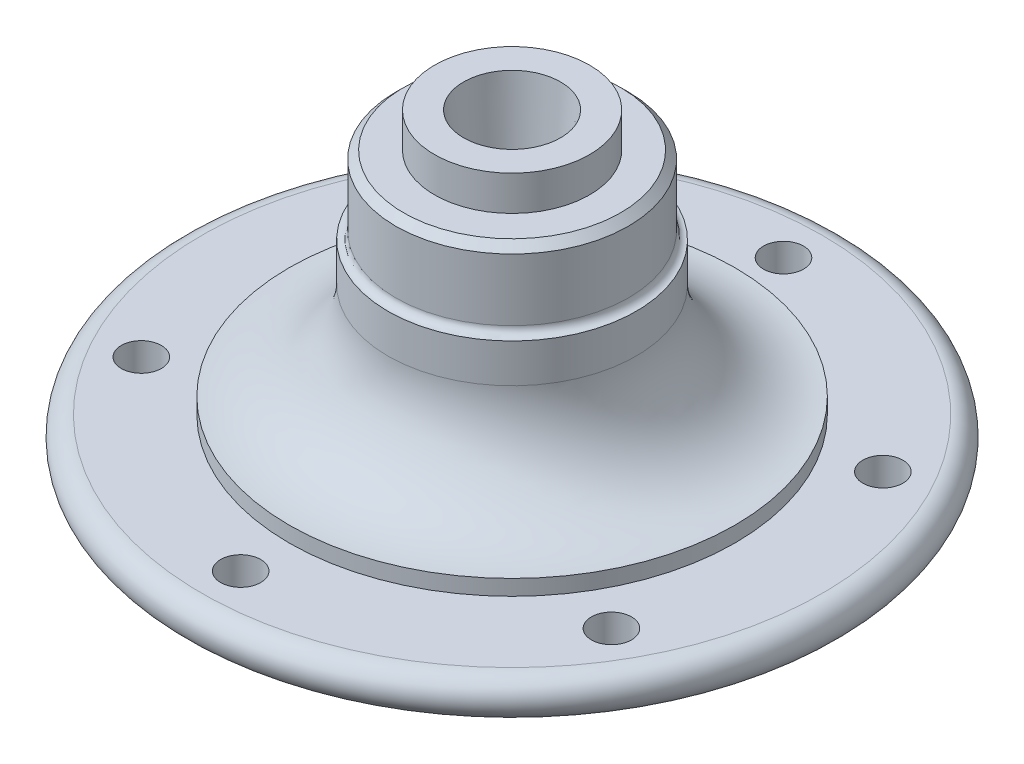
ISO-10303-21;
HEADER;
FILE_DESCRIPTION(('STEP AP214'),'2;1');
FILE_NAME('part.step','',(''),(''),'','','');
FILE_SCHEMA(('AUTOMOTIVE_DESIGN { 1 0 10303 214 1 1 1 1 }'));
ENDSEC;
DATA;
#1=APPLICATION_CONTEXT('core data for automotive mechanical design processes');
#2=APPLICATION_PROTOCOL_DEFINITION('international standard','automotive_design',2000,#1);
#3=PRODUCT_CONTEXT('',#1,'mechanical');
#4=PRODUCT('Part','Part','',(#3));
#5=PRODUCT_RELATED_PRODUCT_CATEGORY('part','',(#4));
#6=PRODUCT_DEFINITION_FORMATION('','',#4);
#7=PRODUCT_DEFINITION_CONTEXT('part definition',#1,'design');
#8=PRODUCT_DEFINITION('design','',#6,#7);
#9=PRODUCT_DEFINITION_SHAPE('','',#8);
#10=(LENGTH_UNIT() NAMED_UNIT(*) SI_UNIT(.MILLI.,.METRE.));
#11=(NAMED_UNIT(*) PLANE_ANGLE_UNIT() SI_UNIT($,.RADIAN.));
#12=(NAMED_UNIT(*) SI_UNIT($,.STERADIAN.) SOLID_ANGLE_UNIT());
#13=UNCERTAINTY_MEASURE_WITH_UNIT(LENGTH_MEASURE(1.E-05),#10,'distance_accuracy_value','');
#14=(GEOMETRIC_REPRESENTATION_CONTEXT(3) GLOBAL_UNCERTAINTY_ASSIGNED_CONTEXT((#13)) GLOBAL_UNIT_ASSIGNED_CONTEXT((#10,
#11,#12)) REPRESENTATION_CONTEXT('',''));
#15=CARTESIAN_POINT('',(0.,0.,0.));
#16=DIRECTION('',(0.,0.,1.));
#17=DIRECTION('',(1.,0.,0.));
#18=AXIS2_PLACEMENT_3D('',#15,#16,#17);
#19=CARTESIAN_POINT('',(0.,0.,0.));
#20=DIRECTION('',(0.,-1.,0.));
#21=DIRECTION('',(0.,0.,-1.));
#22=AXIS2_PLACEMENT_3D('',#19,#20,#21);
#23=PLANE('',#22);
#24=CARTESIAN_POINT('',(0.,0.,0.));
#25=DIRECTION('',(0.,-1.,0.));
#26=DIRECTION('',(0.,0.,-1.));
#27=AXIS2_PLACEMENT_3D('',#24,#25,#26);
#28=CIRCLE('',#27,40.);
#29=CARTESIAN_POINT('',(0.,0.,-40.));
#30=VERTEX_POINT('',#29);
#31=EDGE_CURVE('E12',#30,#30,#28,.T.);
#32=ORIENTED_EDGE('',*,*,#31,.T.);
#33=EDGE_LOOP('',(#32));
#34=FACE_BOUND('',#33,.T.);
#35=ADVANCED_FACE('F45',(#34),#23,.T.);
#36=CARTESIAN_POINT('',(0.,0.,0.));
#37=DIRECTION('',(0.,-1.,0.));
#38=DIRECTION('',(0.,0.,-1.));
#39=AXIS2_PLACEMENT_3D('',#36,#37,#38);
#40=CYLINDRICAL_SURFACE('',#39,40.);
#41=CARTESIAN_POINT('',(0.,12.,0.));
#42=DIRECTION('',(0.,-1.,0.));
#43=DIRECTION('',(0.,0.,-1.));
#44=AXIS2_PLACEMENT_3D('',#41,#42,#43);
#45=CIRCLE('',#44,40.);
#46=CARTESIAN_POINT('',(0.,12.,-40.));
#47=VERTEX_POINT('',#46);
#48=EDGE_CURVE('E52',#47,#47,#45,.T.);
#49=ORIENTED_EDGE('',*,*,#48,.T.);
#50=EDGE_LOOP('',(#49));
#51=FACE_BOUND('',#50,.T.);
#52=ORIENTED_EDGE('',*,*,#31,.F.);
#53=EDGE_LOOP('',(#52));
#54=FACE_BOUND('',#53,.T.);
#55=ADVANCED_FACE('F150',(#51,#54),#40,.T.);
#56=CARTESIAN_POINT('',(40.,12.,0.));
#57=DIRECTION('',(0.,-1.,0.));
#58=DIRECTION('',(0.,0.,-1.));
#59=AXIS2_PLACEMENT_3D('',#56,#57,#58);
#60=PLANE('',#59);
#61=CARTESIAN_POINT('',(60.6217782649103,12.,35.0000000000007));
#62=DIRECTION('',(0.,-1.,0.));
#63=DIRECTION('',(-0.866025403784433,0.,-0.50000000000001));
#64=AXIS2_PLACEMENT_3D('',#61,#62,#63);
#65=CIRCLE('',#64,5.16487312136871);
#66=CARTESIAN_POINT('',(56.1488669344816,12.,32.4175634393163));
#67=VERTEX_POINT('',#66);
#68=EDGE_CURVE('E89',#67,#67,#65,.T.);
#69=ORIENTED_EDGE('',*,*,#68,.F.);
#70=EDGE_LOOP('',(#69));
#71=FACE_BOUND('',#70,.T.);
#72=CARTESIAN_POINT('',(60.621778264911,12.,-34.9999999999994));
#73=DIRECTION('',(0.,-1.,0.));
#74=DIRECTION('',(-0.866025403784443,0.,0.499999999999992));
#75=AXIS2_PLACEMENT_3D('',#72,#73,#74);
#76=CIRCLE('',#75,5.16487312136871);
#77=CARTESIAN_POINT('',(56.1488669344823,12.,-32.4175634393151));
#78=VERTEX_POINT('',#77);
#79=EDGE_CURVE('E79',#78,#78,#76,.T.);
#80=ORIENTED_EDGE('',*,*,#79,.F.);
#81=EDGE_LOOP('',(#80));
#82=FACE_BOUND('',#81,.T.);
#83=CARTESIAN_POINT('',(0.,12.,-70.));
#84=DIRECTION('',(0.,-1.,0.));
#85=DIRECTION('',(0.,0.,1.));
#86=AXIS2_PLACEMENT_3D('',#83,#84,#85);
#87=CIRCLE('',#86,5.16487312136871);
#88=CARTESIAN_POINT('',(0.,12.,-64.8351268786313));
#89=VERTEX_POINT('',#88);
#90=EDGE_CURVE('E76',#89,#89,#87,.T.);
#91=ORIENTED_EDGE('',*,*,#90,.F.);
#92=EDGE_LOOP('',(#91));
#93=FACE_BOUND('',#92,.T.);
#94=CARTESIAN_POINT('',(-60.6217782649106,12.,-35.0000000000003));
#95=DIRECTION('',(0.,-1.,0.));
#96=DIRECTION('',(0.866025403784436,0.,0.500000000000004));
#97=AXIS2_PLACEMENT_3D('',#94,#95,#96);
#98=CIRCLE('',#97,5.16487312136871);
#99=CARTESIAN_POINT('',(-56.1488669344818,12.,-32.4175634393159));
#100=VERTEX_POINT('',#99);
#101=EDGE_CURVE('E73',#100,#100,#98,.T.);
#102=ORIENTED_EDGE('',*,*,#101,.F.);
#103=EDGE_LOOP('',(#102));
#104=FACE_BOUND('',#103,.T.);
#105=CARTESIAN_POINT('',(-60.6217782649108,12.,34.9999999999999));
#106=DIRECTION('',(0.,-1.,0.));
#107=DIRECTION('',(0.86602540378444,0.,-0.499999999999998));
#108=AXIS2_PLACEMENT_3D('',#105,#106,#107);
#109=CIRCLE('',#108,5.16487312136871);
#110=CARTESIAN_POINT('',(-56.1488669344821,12.,32.4175634393155));
#111=VERTEX_POINT('',#110);
#112=EDGE_CURVE('E69',#111,#111,#109,.T.);
#113=ORIENTED_EDGE('',*,*,#112,.F.);
#114=EDGE_LOOP('',(#113));
#115=FACE_BOUND('',#114,.T.);
#116=CARTESIAN_POINT('',(0.,12.,70.));
#117=DIRECTION('',(0.,-1.,0.));
#118=DIRECTION('',(0.,0.,-1.));
#119=AXIS2_PLACEMENT_3D('',#116,#117,#118);
#120=CIRCLE('',#119,5.16487312136871);
#121=CARTESIAN_POINT('',(0.,12.,64.8351268786313));
#122=VERTEX_POINT('',#121);
#123=EDGE_CURVE('E65',#122,#122,#120,.T.);
#124=ORIENTED_EDGE('',*,*,#123,.F.);
#125=EDGE_LOOP('',(#124));
#126=FACE_BOUND('',#125,.T.);
#127=CARTESIAN_POINT('',(0.,12.,0.));
#128=DIRECTION('',(0.,-1.,0.));
#129=DIRECTION('',(0.,0.,-1.));
#130=AXIS2_PLACEMENT_3D('',#127,#128,#129);
#131=CIRCLE('',#130,80.);
#132=CARTESIAN_POINT('',(0.,12.,-80.));
#133=VERTEX_POINT('',#132);
#134=EDGE_CURVE('E57',#133,#133,#131,.T.);
#135=ORIENTED_EDGE('',*,*,#134,.T.);
#136=EDGE_LOOP('',(#135));
#137=FACE_BOUND('',#136,.T.);
#138=ORIENTED_EDGE('',*,*,#48,.F.);
#139=EDGE_LOOP('',(#138));
#140=FACE_BOUND('',#139,.T.);
#141=ADVANCED_FACE('F135',(#71,#82,#93,#104,#115,#126,#137,#140),#60,.T.);
#142=CARTESIAN_POINT('',(0.,17.,0.));
#143=DIRECTION('',(0.,-1.,0.));
#144=DIRECTION('',(0.,0.,-1.));
#145=AXIS2_PLACEMENT_3D('',#142,#143,#144);
#146=TOROIDAL_SURFACE('',#145,80.,5.);
#147=CARTESIAN_POINT('',(0.,22.,0.));
#148=DIRECTION('',(0.,-1.,0.));
#149=DIRECTION('',(0.,0.,-1.));
#150=AXIS2_PLACEMENT_3D('',#147,#148,#149);
#151=CIRCLE('',#150,80.);
#152=CARTESIAN_POINT('',(0.,22.,-80.));
#153=VERTEX_POINT('',#152);
#154=EDGE_CURVE('E130',#153,#153,#151,.T.);
#155=ORIENTED_EDGE('',*,*,#154,.T.);
#156=EDGE_LOOP('',(#155));
#157=FACE_BOUND('',#156,.T.);
#158=ORIENTED_EDGE('',*,*,#134,.F.);
#159=EDGE_LOOP('',(#158));
#160=FACE_BOUND('',#159,.T.);
#161=ADVANCED_FACE('F138',(#157,#160),#146,.T.);
#162=CARTESIAN_POINT('',(80.,22.,0.));
#163=DIRECTION('',(0.,1.,0.));
#164=DIRECTION('',(0.,0.,1.));
#165=AXIS2_PLACEMENT_3D('',#162,#163,#164);
#166=PLANE('',#165);
#167=CARTESIAN_POINT('',(60.6217782649103,22.,35.0000000000007));
#168=DIRECTION('',(0.,1.,0.));
#169=DIRECTION('',(0.,0.,1.));
#170=AXIS2_PLACEMENT_3D('',#167,#168,#169);
#171=CIRCLE('',#170,5.16487312136871);
#172=CARTESIAN_POINT('',(60.6217782649103,22.,40.1648731213694));
#173=VERTEX_POINT('',#172);
#174=EDGE_CURVE('E48',#173,#173,#171,.T.);
#175=ORIENTED_EDGE('',*,*,#174,.F.);
#176=EDGE_LOOP('',(#175));
#177=FACE_BOUND('',#176,.T.);
#178=CARTESIAN_POINT('',(60.621778264911,22.,-34.9999999999994));
#179=DIRECTION('',(0.,1.,0.));
#180=DIRECTION('',(0.,0.,1.));
#181=AXIS2_PLACEMENT_3D('',#178,#179,#180);
#182=CIRCLE('',#181,5.16487312136871);
#183=CARTESIAN_POINT('',(60.621778264911,22.,-29.8351268786307));
#184=VERTEX_POINT('',#183);
#185=EDGE_CURVE('E77',#184,#184,#182,.T.);
#186=ORIENTED_EDGE('',*,*,#185,.F.);
#187=EDGE_LOOP('',(#186));
#188=FACE_BOUND('',#187,.T.);
#189=CARTESIAN_POINT('',(0.,22.,-70.));
#190=DIRECTION('',(0.,1.,0.));
#191=DIRECTION('',(0.,0.,1.));
#192=AXIS2_PLACEMENT_3D('',#189,#190,#191);
#193=CIRCLE('',#192,5.16487312136871);
#194=CARTESIAN_POINT('',(0.,22.,-64.8351268786313));
#195=VERTEX_POINT('',#194);
#196=EDGE_CURVE('E74',#195,#195,#193,.T.);
#197=ORIENTED_EDGE('',*,*,#196,.F.);
#198=EDGE_LOOP('',(#197));
#199=FACE_BOUND('',#198,.T.);
#200=CARTESIAN_POINT('',(-60.6217782649106,22.,-35.0000000000003));
#201=DIRECTION('',(0.,1.,0.));
#202=DIRECTION('',(0.,0.,1.));
#203=AXIS2_PLACEMENT_3D('',#200,#201,#202);
#204=CIRCLE('',#203,5.16487312136871);
#205=CARTESIAN_POINT('',(-60.6217782649106,22.,-29.8351268786316));
#206=VERTEX_POINT('',#205);
#207=EDGE_CURVE('E70',#206,#206,#204,.T.);
#208=ORIENTED_EDGE('',*,*,#207,.F.);
#209=EDGE_LOOP('',(#208));
#210=FACE_BOUND('',#209,.T.);
#211=CARTESIAN_POINT('',(-60.6217782649108,22.,34.9999999999999));
#212=DIRECTION('',(0.,1.,0.));
#213=DIRECTION('',(0.,0.,1.));
#214=AXIS2_PLACEMENT_3D('',#211,#212,#213);
#215=CIRCLE('',#214,5.16487312136871);
#216=CARTESIAN_POINT('',(-60.6217782649108,22.,40.1648731213686));
#217=VERTEX_POINT('',#216);
#218=EDGE_CURVE('E66',#217,#217,#215,.T.);
#219=ORIENTED_EDGE('',*,*,#218,.F.);
#220=EDGE_LOOP('',(#219));
#221=FACE_BOUND('',#220,.T.);
#222=CARTESIAN_POINT('',(0.,22.,70.));
#223=DIRECTION('',(0.,1.,0.));
#224=DIRECTION('',(0.,0.,1.));
#225=AXIS2_PLACEMENT_3D('',#222,#223,#224);
#226=CIRCLE('',#225,5.16487312136871);
#227=CARTESIAN_POINT('',(0.,22.,75.1648731213687));
#228=VERTEX_POINT('',#227);
#229=EDGE_CURVE('E61',#228,#228,#226,.T.);
#230=ORIENTED_EDGE('',*,*,#229,.F.);
#231=EDGE_LOOP('',(#230));
#232=FACE_BOUND('',#231,.T.);
#233=CARTESIAN_POINT('',(0.,22.,0.));
#234=DIRECTION('',(0.,-1.,0.));
#235=DIRECTION('',(0.,0.,-1.));
#236=AXIS2_PLACEMENT_3D('',#233,#234,#235);
#237=CIRCLE('',#236,57.5);
#238=CARTESIAN_POINT('',(0.,22.,-57.5));
#239=VERTEX_POINT('',#238);
#240=EDGE_CURVE('E127',#239,#239,#237,.T.);
#241=ORIENTED_EDGE('',*,*,#240,.T.);
#242=EDGE_LOOP('',(#241));
#243=FACE_BOUND('',#242,.T.);
#244=ORIENTED_EDGE('',*,*,#154,.F.);
#245=EDGE_LOOP('',(#244));
#246=FACE_BOUND('',#245,.T.);
#247=ADVANCED_FACE('F140',(#177,#188,#199,#210,#221,#232,#243,#246),#166,.T.);
#248=CARTESIAN_POINT('',(0.,0.,0.));
#249=DIRECTION('',(0.,-1.,0.));
#250=DIRECTION('',(0.,0.,-1.));
#251=AXIS2_PLACEMENT_3D('',#248,#249,#250);
#252=CYLINDRICAL_SURFACE('',#251,57.5);
#253=CARTESIAN_POINT('',(0.,26.,0.));
#254=DIRECTION('',(0.,-1.,0.));
#255=DIRECTION('',(0.,0.,-1.));
#256=AXIS2_PLACEMENT_3D('',#253,#254,#255);
#257=CIRCLE('',#256,57.5);
#258=CARTESIAN_POINT('',(0.,26.,-57.5));
#259=VERTEX_POINT('',#258);
#260=EDGE_CURVE('E124',#259,#259,#257,.T.);
#261=ORIENTED_EDGE('',*,*,#260,.T.);
#262=EDGE_LOOP('',(#261));
#263=FACE_BOUND('',#262,.T.);
#264=ORIENTED_EDGE('',*,*,#240,.F.);
#265=EDGE_LOOP('',(#264));
#266=FACE_BOUND('',#265,.T.);
#267=ADVANCED_FACE('F147',(#263,#266),#252,.T.);
#268=CARTESIAN_POINT('',(0.,50.9949994999,0.));
#269=DIRECTION('',(0.,-1.,0.));
#270=DIRECTION('',(0.,0.,-1.));
#271=AXIS2_PLACEMENT_3D('',#268,#269,#270);
#272=TOROIDAL_SURFACE('',#271,57.,25.);
#273=CARTESIAN_POINT('',(0.,50.9949994999,0.));
#274=DIRECTION('',(0.,-1.,0.));
#275=DIRECTION('',(0.,0.,-1.));
#276=AXIS2_PLACEMENT_3D('',#273,#274,#275);
#277=CIRCLE('',#276,32.);
#278=CARTESIAN_POINT('',(0.,50.9949994999,-32.));
#279=VERTEX_POINT('',#278);
#280=EDGE_CURVE('E121',#279,#279,#277,.T.);
#281=ORIENTED_EDGE('',*,*,#280,.T.);
#282=EDGE_LOOP('',(#281));
#283=FACE_BOUND('',#282,.T.);
#284=ORIENTED_EDGE('',*,*,#260,.F.);
#285=EDGE_LOOP('',(#284));
#286=FACE_BOUND('',#285,.T.);
#287=ADVANCED_FACE('F273',(#283,#286),#272,.F.);
#288=CARTESIAN_POINT('',(0.,0.,0.));
#289=DIRECTION('',(0.,-1.,0.));
#290=DIRECTION('',(0.,0.,-1.));
#291=AXIS2_PLACEMENT_3D('',#288,#289,#290);
#292=CYLINDRICAL_SURFACE('',#291,32.);
#293=CARTESIAN_POINT('',(0.,60.9949994999,0.));
#294=DIRECTION('',(0.,-1.,0.));
#295=DIRECTION('',(0.,0.,-1.));
#296=AXIS2_PLACEMENT_3D('',#293,#294,#295);
#297=CIRCLE('',#296,32.);
#298=CARTESIAN_POINT('',(0.,60.9949994999,-32.));
#299=VERTEX_POINT('',#298);
#300=EDGE_CURVE('E118',#299,#299,#297,.T.);
#301=ORIENTED_EDGE('',*,*,#300,.T.);
#302=EDGE_LOOP('',(#301));
#303=FACE_BOUND('',#302,.T.);
#304=ORIENTED_EDGE('',*,*,#280,.F.);
#305=EDGE_LOOP('',(#304));
#306=FACE_BOUND('',#305,.T.);
#307=ADVANCED_FACE('F269',(#303,#306),#292,.T.);
#308=CARTESIAN_POINT('',(0.,62.9949994999,0.));
#309=DIRECTION('',(0.,-1.,0.));
#310=DIRECTION('',(0.,0.,-1.));
#311=AXIS2_PLACEMENT_3D('',#308,#309,#310);
#312=TOROIDAL_SURFACE('',#311,32.,2.);
#313=CARTESIAN_POINT('',(0.,62.9949994999,0.));
#314=DIRECTION('',(0.,-1.,0.));
#315=DIRECTION('',(0.,0.,-1.));
#316=AXIS2_PLACEMENT_3D('',#313,#314,#315);
#317=CIRCLE('',#316,30.);
#318=CARTESIAN_POINT('',(0.,62.9949994999,-30.));
#319=VERTEX_POINT('',#318);
#320=EDGE_CURVE('E115',#319,#319,#317,.T.);
#321=ORIENTED_EDGE('',*,*,#320,.T.);
#322=EDGE_LOOP('',(#321));
#323=FACE_BOUND('',#322,.T.);
#324=ORIENTED_EDGE('',*,*,#300,.F.);
#325=EDGE_LOOP('',(#324));
#326=FACE_BOUND('',#325,.T.);
#327=ADVANCED_FACE('F265',(#323,#326),#312,.F.);
#328=CARTESIAN_POINT('',(0.,0.,0.));
#329=DIRECTION('',(0.,-1.,0.));
#330=DIRECTION('',(0.,0.,-1.));
#331=AXIS2_PLACEMENT_3D('',#328,#329,#330);
#332=CYLINDRICAL_SURFACE('',#331,30.);
#333=CARTESIAN_POINT('',(0.,79.,0.));
#334=DIRECTION('',(0.,-1.,0.));
#335=DIRECTION('',(0.,0.,-1.));
#336=AXIS2_PLACEMENT_3D('',#333,#334,#335);
#337=CIRCLE('',#336,30.);
#338=CARTESIAN_POINT('',(0.,79.,-30.));
#339=VERTEX_POINT('',#338);
#340=EDGE_CURVE('E112',#339,#339,#337,.T.);
#341=ORIENTED_EDGE('',*,*,#340,.T.);
#342=EDGE_LOOP('',(#341));
#343=FACE_BOUND('',#342,.T.);
#344=ORIENTED_EDGE('',*,*,#320,.F.);
#345=EDGE_LOOP('',(#344));
#346=FACE_BOUND('',#345,.T.);
#347=ADVANCED_FACE('F261',(#343,#346),#332,.T.);
#348=CARTESIAN_POINT('',(0.,79.,0.));
#349=DIRECTION('',(0.,-1.,0.));
#350=DIRECTION('',(0.,0.,-1.));
#351=AXIS2_PLACEMENT_3D('',#348,#349,#350);
#352=CONICAL_SURFACE('',#351,30.,0.78539816339745);
#353=CARTESIAN_POINT('',(0.,81.,0.));
#354=DIRECTION('',(0.,-1.,0.));
#355=DIRECTION('',(0.,0.,-1.));
#356=AXIS2_PLACEMENT_3D('',#353,#354,#355);
#357=CIRCLE('',#356,28.);
#358=CARTESIAN_POINT('',(0.,81.,-28.));
#359=VERTEX_POINT('',#358);
#360=EDGE_CURVE('E109',#359,#359,#357,.T.);
#361=ORIENTED_EDGE('',*,*,#360,.T.);
#362=EDGE_LOOP('',(#361));
#363=FACE_BOUND('',#362,.T.);
#364=ORIENTED_EDGE('',*,*,#340,.F.);
#365=EDGE_LOOP('',(#364));
#366=FACE_BOUND('',#365,.T.);
#367=ADVANCED_FACE('F257',(#363,#366),#352,.T.);
#368=CARTESIAN_POINT('',(20.,81.,0.));
#369=DIRECTION('',(0.,1.,0.));
#370=DIRECTION('',(0.,0.,1.));
#371=AXIS2_PLACEMENT_3D('',#368,#369,#370);
#372=PLANE('',#371);
#373=CARTESIAN_POINT('',(0.,81.,0.));
#374=DIRECTION('',(0.,-1.,0.));
#375=DIRECTION('',(0.,0.,-1.));
#376=AXIS2_PLACEMENT_3D('',#373,#374,#375);
#377=CIRCLE('',#376,20.);
#378=CARTESIAN_POINT('',(0.,81.,-20.));
#379=VERTEX_POINT('',#378);
#380=EDGE_CURVE('E106',#379,#379,#377,.T.);
#381=ORIENTED_EDGE('',*,*,#380,.T.);
#382=EDGE_LOOP('',(#381));
#383=FACE_BOUND('',#382,.T.);
#384=ORIENTED_EDGE('',*,*,#360,.F.);
#385=EDGE_LOOP('',(#384));
#386=FACE_BOUND('',#385,.T.);
#387=ADVANCED_FACE('F253',(#383,#386),#372,.T.);
#388=CARTESIAN_POINT('',(0.,0.,0.));
#389=DIRECTION('',(0.,-1.,0.));
#390=DIRECTION('',(0.,0.,-1.));
#391=AXIS2_PLACEMENT_3D('',#388,#389,#390);
#392=CYLINDRICAL_SURFACE('',#391,20.);
#393=CARTESIAN_POINT('',(0.,90.,0.));
#394=DIRECTION('',(0.,-1.,0.));
#395=DIRECTION('',(0.,0.,-1.));
#396=AXIS2_PLACEMENT_3D('',#393,#394,#395);
#397=CIRCLE('',#396,20.);
#398=CARTESIAN_POINT('',(0.,90.,-20.));
#399=VERTEX_POINT('',#398);
#400=EDGE_CURVE('E103',#399,#399,#397,.T.);
#401=ORIENTED_EDGE('',*,*,#400,.T.);
#402=EDGE_LOOP('',(#401));
#403=FACE_BOUND('',#402,.T.);
#404=ORIENTED_EDGE('',*,*,#380,.F.);
#405=EDGE_LOOP('',(#404));
#406=FACE_BOUND('',#405,.T.);
#407=ADVANCED_FACE('F249',(#403,#406),#392,.T.);
#408=CARTESIAN_POINT('',(0.,90.,0.));
#409=DIRECTION('',(0.,1.,0.));
#410=DIRECTION('',(0.,0.,1.));
#411=AXIS2_PLACEMENT_3D('',#408,#409,#410);
#412=PLANE('',#411);
#413=CARTESIAN_POINT('',(0.,90.,0.));
#414=DIRECTION('',(0.,1.,0.));
#415=DIRECTION('',(0.,0.,1.));
#416=AXIS2_PLACEMENT_3D('',#413,#414,#415);
#417=CIRCLE('',#416,12.5);
#418=CARTESIAN_POINT('',(0.,90.,12.5));
#419=VERTEX_POINT('',#418);
#420=EDGE_CURVE('E64',#419,#419,#417,.T.);
#421=ORIENTED_EDGE('',*,*,#420,.F.);
#422=EDGE_LOOP('',(#421));
#423=FACE_BOUND('',#422,.T.);
#424=ORIENTED_EDGE('',*,*,#400,.F.);
#425=EDGE_LOOP('',(#424));
#426=FACE_BOUND('',#425,.T.);
#427=ADVANCED_FACE('F245',(#423,#426),#412,.T.);
#428=CARTESIAN_POINT('',(0.,90.,0.));
#429=DIRECTION('',(0.,1.,0.));
#430=DIRECTION('',(0.,0.,1.));
#431=AXIS2_PLACEMENT_3D('',#428,#429,#430);
#432=CONICAL_SURFACE('',#431,12.5,0.0872664625997167);
#433=CARTESIAN_POINT('',(0.,70.,0.));
#434=DIRECTION('',(0.,1.,0.));
#435=DIRECTION('',(0.,0.,1.));
#436=AXIS2_PLACEMENT_3D('',#433,#434,#435);
#437=CIRCLE('',#436,10.7502267294815);
#438=CARTESIAN_POINT('',(0.,70.,10.7502267294815));
#439=VERTEX_POINT('',#438);
#440=EDGE_CURVE('E100',#439,#439,#437,.T.);
#441=ORIENTED_EDGE('',*,*,#440,.F.);
#442=EDGE_LOOP('',(#441));
#443=FACE_BOUND('',#442,.T.);
#444=ORIENTED_EDGE('',*,*,#420,.T.);
#445=EDGE_LOOP('',(#444));
#446=FACE_BOUND('',#445,.T.);
#447=ADVANCED_FACE('F241',(#443,#446),#432,.F.);
#448=CARTESIAN_POINT('',(0.,70.,0.));
#449=DIRECTION('',(0.,1.,0.));
#450=DIRECTION('',(0.,0.,1.));
#451=AXIS2_PLACEMENT_3D('',#448,#449,#450);
#452=PLANE('',#451);
#453=ORIENTED_EDGE('',*,*,#440,.T.);
#454=EDGE_LOOP('',(#453));
#455=FACE_BOUND('',#454,.T.);
#456=ADVANCED_FACE('F237',(#455),#452,.T.);
#457=CARTESIAN_POINT('',(0.,90.,70.));
#458=DIRECTION('',(0.,-1.,0.));
#459=DIRECTION('',(0.,0.,-1.));
#460=AXIS2_PLACEMENT_3D('',#457,#458,#459);
#461=CYLINDRICAL_SURFACE('',#460,5.16487312136871);
#462=ORIENTED_EDGE('',*,*,#229,.T.);
#463=EDGE_LOOP('',(#462));
#464=FACE_BOUND('',#463,.T.);
#465=ORIENTED_EDGE('',*,*,#123,.T.);
#466=EDGE_LOOP('',(#465));
#467=FACE_BOUND('',#466,.T.);
#468=ADVANCED_FACE('F173',(#464,#467),#461,.F.);
#469=CARTESIAN_POINT('',(-60.6217782649108,90.,34.9999999999999));
#470=DIRECTION('',(0.,-1.,0.));
#471=DIRECTION('',(0.,0.,-1.));
#472=AXIS2_PLACEMENT_3D('',#469,#470,#471);
#473=CYLINDRICAL_SURFACE('',#472,5.16487312136871);
#474=ORIENTED_EDGE('',*,*,#218,.T.);
#475=EDGE_LOOP('',(#474));
#476=FACE_BOUND('',#475,.T.);
#477=ORIENTED_EDGE('',*,*,#112,.T.);
#478=EDGE_LOOP('',(#477));
#479=FACE_BOUND('',#478,.T.);
#480=ADVANCED_FACE('F186',(#476,#479),#473,.F.);
#481=CARTESIAN_POINT('',(-60.6217782649106,90.,-35.0000000000003));
#482=DIRECTION('',(0.,-1.,0.));
#483=DIRECTION('',(0.,0.,-1.));
#484=AXIS2_PLACEMENT_3D('',#481,#482,#483);
#485=CYLINDRICAL_SURFACE('',#484,5.16487312136871);
#486=ORIENTED_EDGE('',*,*,#207,.T.);
#487=EDGE_LOOP('',(#486));
#488=FACE_BOUND('',#487,.T.);
#489=ORIENTED_EDGE('',*,*,#101,.T.);
#490=EDGE_LOOP('',(#489));
#491=FACE_BOUND('',#490,.T.);
#492=ADVANCED_FACE('F191',(#488,#491),#485,.F.);
#493=CARTESIAN_POINT('',(0.,90.,-70.));
#494=DIRECTION('',(0.,-1.,0.));
#495=DIRECTION('',(0.,0.,-1.));
#496=AXIS2_PLACEMENT_3D('',#493,#494,#495);
#497=CYLINDRICAL_SURFACE('',#496,5.16487312136871);
#498=ORIENTED_EDGE('',*,*,#196,.T.);
#499=EDGE_LOOP('',(#498));
#500=FACE_BOUND('',#499,.T.);
#501=ORIENTED_EDGE('',*,*,#90,.T.);
#502=EDGE_LOOP('',(#501));
#503=FACE_BOUND('',#502,.T.);
#504=ADVANCED_FACE('F201',(#500,#503),#497,.F.);
#505=CARTESIAN_POINT('',(60.621778264911,90.,-34.9999999999994));
#506=DIRECTION('',(0.,-1.,0.));
#507=DIRECTION('',(0.,0.,-1.));
#508=AXIS2_PLACEMENT_3D('',#505,#506,#507);
#509=CYLINDRICAL_SURFACE('',#508,5.16487312136871);
#510=ORIENTED_EDGE('',*,*,#185,.T.);
#511=EDGE_LOOP('',(#510));
#512=FACE_BOUND('',#511,.T.);
#513=ORIENTED_EDGE('',*,*,#79,.T.);
#514=EDGE_LOOP('',(#513));
#515=FACE_BOUND('',#514,.T.);
#516=ADVANCED_FACE('F211',(#512,#515),#509,.F.);
#517=CARTESIAN_POINT('',(60.6217782649103,90.,35.0000000000007));
#518=DIRECTION('',(0.,-1.,0.));
#519=DIRECTION('',(0.,0.,-1.));
#520=AXIS2_PLACEMENT_3D('',#517,#518,#519);
#521=CYLINDRICAL_SURFACE('',#520,5.16487312136871);
#522=ORIENTED_EDGE('',*,*,#174,.T.);
#523=EDGE_LOOP('',(#522));
#524=FACE_BOUND('',#523,.T.);
#525=ORIENTED_EDGE('',*,*,#68,.T.);
#526=EDGE_LOOP('',(#525));
#527=FACE_BOUND('',#526,.T.);
#528=ADVANCED_FACE('F221',(#524,#527),#521,.F.);
#529=CLOSED_SHELL('',(#35,#55,#141,#161,#247,#267,#287,#307,#327,#347,#367,#387,#407,#427,#447,
#456,#468,#480,#492,#504,#516,#528));
#530=MANIFOLD_SOLID_BREP('B2',#529);
#531=ADVANCED_BREP_SHAPE_REPRESENTATION('',(#18,#530),#14);
#532=SHAPE_DEFINITION_REPRESENTATION(#9,#531);
ENDSEC;
END-ISO-10303-21;
